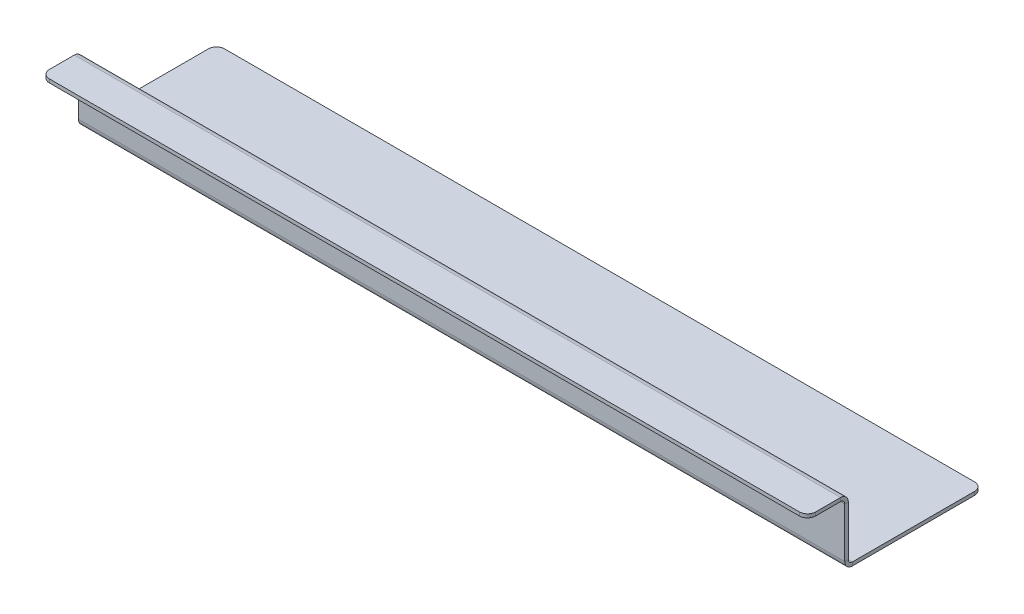
ISO-10303-21;
HEADER;
FILE_DESCRIPTION(('STEP AP214'),'2;1');
FILE_NAME('part.step','',(''),(''),'','','');
FILE_SCHEMA(('AUTOMOTIVE_DESIGN { 1 0 10303 214 1 1 1 1 }'));
ENDSEC;
DATA;
#1=APPLICATION_CONTEXT('core data for automotive mechanical design processes');
#2=APPLICATION_PROTOCOL_DEFINITION('international standard','automotive_design',2000,#1);
#3=PRODUCT_CONTEXT('',#1,'mechanical');
#4=PRODUCT('Part','Part','',(#3));
#5=PRODUCT_RELATED_PRODUCT_CATEGORY('part','',(#4));
#6=PRODUCT_DEFINITION_FORMATION('','',#4);
#7=PRODUCT_DEFINITION_CONTEXT('part definition',#1,'design');
#8=PRODUCT_DEFINITION('design','',#6,#7);
#9=PRODUCT_DEFINITION_SHAPE('','',#8);
#10=(LENGTH_UNIT() NAMED_UNIT(*) SI_UNIT(.MILLI.,.METRE.));
#11=(NAMED_UNIT(*) PLANE_ANGLE_UNIT() SI_UNIT($,.RADIAN.));
#12=(NAMED_UNIT(*) SI_UNIT($,.STERADIAN.) SOLID_ANGLE_UNIT());
#13=UNCERTAINTY_MEASURE_WITH_UNIT(LENGTH_MEASURE(1.E-05),#10,'distance_accuracy_value','');
#14=(GEOMETRIC_REPRESENTATION_CONTEXT(3) GLOBAL_UNCERTAINTY_ASSIGNED_CONTEXT((#13)) GLOBAL_UNIT_ASSIGNED_CONTEXT((#10,
#11,#12)) REPRESENTATION_CONTEXT('',''));
#15=CARTESIAN_POINT('',(0.,0.,0.));
#16=DIRECTION('',(0.,0.,1.));
#17=DIRECTION('',(1.,0.,0.));
#18=AXIS2_PLACEMENT_3D('',#15,#16,#17);
#19=CARTESIAN_POINT('',(596.9,-50.8,-31.7500000000002));
#20=DIRECTION('',(-1.,0.,0.));
#21=DIRECTION('',(0.,0.,1.));
#22=AXIS2_PLACEMENT_3D('',#19,#20,#21);
#23=PLANE('',#22);
#24=DIRECTION('',(0.,0.,1.));
#25=VECTOR('',#24,1.);
#26=CARTESIAN_POINT('',(596.9,-44.87164,-31.7500000000001));
#27=LINE('',#26,#25);
#28=CARTESIAN_POINT('',(596.9,-44.87164,-31.7500000000001));
#29=VERTEX_POINT('',#28);
#30=CARTESIAN_POINT('',(596.9,-44.87164,-28.9966400000001));
#31=VERTEX_POINT('',#30);
#32=EDGE_CURVE('E250',#29,#31,#27,.T.);
#33=ORIENTED_EDGE('',*,*,#32,.F.);
#34=DIRECTION('',(0.,-1.,0.));
#35=VECTOR('',#34,1.);
#36=CARTESIAN_POINT('',(596.9,1.19661315799875E-13,-31.75));
#37=LINE('',#36,#35);
#38=CARTESIAN_POINT('',(596.9,-5.92835999999999,-31.75));
#39=VERTEX_POINT('',#38);
#40=EDGE_CURVE('E258',#39,#29,#37,.T.);
#41=ORIENTED_EDGE('',*,*,#40,.F.);
#42=DIRECTION('',(0.,0.,1.));
#43=VECTOR('',#42,1.);
#44=CARTESIAN_POINT('',(596.9,-5.92836000000001,-28.99664));
#45=LINE('',#44,#43);
#46=CARTESIAN_POINT('',(596.9,-5.92836000000005,-28.99664));
#47=VERTEX_POINT('',#46);
#48=EDGE_CURVE('E269',#47,#39,#45,.F.);
#49=ORIENTED_EDGE('',*,*,#48,.F.);
#50=DIRECTION('',(0.,1.,0.));
#51=VECTOR('',#50,1.);
#52=CARTESIAN_POINT('',(596.9,-50.8,-28.9966400000002));
#53=LINE('',#52,#51);
#54=EDGE_CURVE('E263',#47,#31,#53,.F.);
#55=ORIENTED_EDGE('',*,*,#54,.T.);
#56=EDGE_LOOP('',(#33,#41,#49,#55));
#57=FACE_BOUND('',#56,.T.);
#58=ADVANCED_FACE('F81',(#57),#23,.F.);
#59=CARTESIAN_POINT('',(0.,-2.75335999999999,-31.75));
#60=DIRECTION('',(1.,0.,0.));
#61=DIRECTION('',(0.,0.,-1.));
#62=AXIS2_PLACEMENT_3D('',#59,#60,#61);
#63=PLANE('',#62);
#64=DIRECTION('',(0.,0.,1.));
#65=VECTOR('',#64,1.);
#66=CARTESIAN_POINT('',(0.,-44.87164,-31.7500000000001));
#67=LINE('',#66,#65);
#68=CARTESIAN_POINT('',(0.,-44.87164,-31.7500000000001));
#69=VERTEX_POINT('',#68);
#70=CARTESIAN_POINT('',(0.,-44.87164,-28.9966400000001));
#71=VERTEX_POINT('',#70);
#72=EDGE_CURVE('E243',#69,#71,#67,.T.);
#73=ORIENTED_EDGE('',*,*,#72,.T.);
#74=DIRECTION('',(0.,-1.,0.));
#75=VECTOR('',#74,1.);
#76=CARTESIAN_POINT('',(0.,-2.75336,-28.99664));
#77=LINE('',#76,#75);
#78=CARTESIAN_POINT('',(0.,-5.92835999999997,-28.99664));
#79=VERTEX_POINT('',#78);
#80=EDGE_CURVE('E261',#71,#79,#77,.F.);
#81=ORIENTED_EDGE('',*,*,#80,.T.);
#82=DIRECTION('',(0.,0.,1.));
#83=VECTOR('',#82,1.);
#84=CARTESIAN_POINT('',(0.,-5.92835999999997,-31.75));
#85=LINE('',#84,#83);
#86=CARTESIAN_POINT('',(0.,-5.92835999999996,-31.75));
#87=VERTEX_POINT('',#86);
#88=EDGE_CURVE('E253',#79,#87,#85,.F.);
#89=ORIENTED_EDGE('',*,*,#88,.T.);
#90=DIRECTION('',(0.,1.,0.));
#91=VECTOR('',#90,1.);
#92=CARTESIAN_POINT('',(0.,1.19661315799875E-13,-31.75));
#93=LINE('',#92,#91);
#94=EDGE_CURVE('E255',#69,#87,#93,.T.);
#95=ORIENTED_EDGE('',*,*,#94,.F.);
#96=EDGE_LOOP('',(#73,#81,#89,#95));
#97=FACE_BOUND('',#96,.T.);
#98=ADVANCED_FACE('F383',(#97),#63,.F.);
#99=CARTESIAN_POINT('',(0.,1.19661315799875E-13,-31.75));
#100=DIRECTION('',(0.,0.,1.));
#101=DIRECTION('',(0.,-1.,0.));
#102=AXIS2_PLACEMENT_3D('',#99,#100,#101);
#103=PLANE('',#102);
#104=DIRECTION('',(-1.,0.,0.));
#105=VECTOR('',#104,1.);
#106=CARTESIAN_POINT('',(0.,-44.87164,-31.7500000000001));
#107=LINE('',#106,#105);
#108=EDGE_CURVE('E247',#69,#29,#107,.F.);
#109=ORIENTED_EDGE('',*,*,#108,.F.);
#110=ORIENTED_EDGE('',*,*,#94,.T.);
#111=DIRECTION('',(1.,0.,0.));
#112=VECTOR('',#111,1.);
#113=CARTESIAN_POINT('',(0.,-5.92835999999997,-31.75));
#114=LINE('',#113,#112);
#115=EDGE_CURVE('E266',#39,#87,#114,.F.);
#116=ORIENTED_EDGE('',*,*,#115,.F.);
#117=ORIENTED_EDGE('',*,*,#40,.T.);
#118=EDGE_LOOP('',(#109,#110,#116,#117));
#119=FACE_BOUND('',#118,.T.);
#120=ADVANCED_FACE('F372',(#119),#103,.F.);
#121=CARTESIAN_POINT('',(0.,1.10048010740757E-13,-28.99664));
#122=DIRECTION('',(0.,0.,1.));
#123=DIRECTION('',(0.,-1.,0.));
#124=AXIS2_PLACEMENT_3D('',#121,#122,#123);
#125=PLANE('',#124);
#126=ORIENTED_EDGE('',*,*,#80,.F.);
#127=DIRECTION('',(-1.,0.,0.));
#128=VECTOR('',#127,1.);
#129=CARTESIAN_POINT('',(0.,-44.87164,-28.9966400000001));
#130=LINE('',#129,#128);
#131=EDGE_CURVE('E204',#71,#31,#130,.F.);
#132=ORIENTED_EDGE('',*,*,#131,.T.);
#133=ORIENTED_EDGE('',*,*,#54,.F.);
#134=DIRECTION('',(1.,0.,0.));
#135=VECTOR('',#134,1.);
#136=CARTESIAN_POINT('',(0.,-5.92835999999999,-28.99664));
#137=LINE('',#136,#135);
#138=EDGE_CURVE('E272',#79,#47,#137,.T.);
#139=ORIENTED_EDGE('',*,*,#138,.F.);
#140=EDGE_LOOP('',(#126,#132,#133,#139));
#141=FACE_BOUND('',#140,.T.);
#142=ADVANCED_FACE('F387',(#141),#125,.T.);
#143=CARTESIAN_POINT('',(596.9,-2.75336,0.));
#144=DIRECTION('',(1.,0.,0.));
#145=DIRECTION('',(0.,0.,-1.));
#146=AXIS2_PLACEMENT_3D('',#143,#144,#145);
#147=PLANE('',#146);
#148=DIRECTION('',(0.,0.,-1.));
#149=VECTOR('',#148,1.);
#150=CARTESIAN_POINT('',(596.9,0.,0.));
#151=LINE('',#150,#149);
#152=CARTESIAN_POINT('',(596.9,0.,-6.35));
#153=VERTEX_POINT('',#152);
#154=CARTESIAN_POINT('',(596.9,0.,-25.82164));
#155=VERTEX_POINT('',#154);
#156=EDGE_CURVE('E303',#153,#155,#151,.T.);
#157=ORIENTED_EDGE('',*,*,#156,.F.);
#158=DIRECTION('',(0.,1.,0.));
#159=VECTOR('',#158,1.);
#160=CARTESIAN_POINT('',(596.9,-2.75336,-6.35));
#161=LINE('',#160,#159);
#162=CARTESIAN_POINT('',(596.9,-2.75336,-6.35));
#163=VERTEX_POINT('',#162);
#164=EDGE_CURVE('E323',#153,#163,#161,.F.);
#165=ORIENTED_EDGE('',*,*,#164,.T.);
#166=DIRECTION('',(0.,0.,-1.));
#167=VECTOR('',#166,1.);
#168=CARTESIAN_POINT('',(596.9,-2.75336,0.));
#169=LINE('',#168,#167);
#170=CARTESIAN_POINT('',(596.9,-2.75336,-25.82164));
#171=VERTEX_POINT('',#170);
#172=EDGE_CURVE('E306',#163,#171,#169,.T.);
#173=ORIENTED_EDGE('',*,*,#172,.T.);
#174=DIRECTION('',(0.,1.,0.));
#175=VECTOR('',#174,1.);
#176=CARTESIAN_POINT('',(596.9,-2.75336000000006,-25.82164));
#177=LINE('',#176,#175);
#178=EDGE_CURVE('E282',#171,#155,#177,.T.);
#179=ORIENTED_EDGE('',*,*,#178,.T.);
#180=EDGE_LOOP('',(#157,#165,#173,#179));
#181=FACE_BOUND('',#180,.T.);
#182=ADVANCED_FACE('F396',(#181),#147,.T.);
#183=CARTESIAN_POINT('',(0.,-2.75336,0.));
#184=DIRECTION('',(0.,-1.,0.));
#185=DIRECTION('',(0.,0.,-1.));
#186=AXIS2_PLACEMENT_3D('',#183,#184,#185);
#187=PLANE('',#186);
#188=ORIENTED_EDGE('',*,*,#172,.F.);
#189=CARTESIAN_POINT('',(590.55,-2.75336,-6.35));
#190=DIRECTION('',(0.,-1.,0.));
#191=DIRECTION('',(0.,0.,-1.));
#192=AXIS2_PLACEMENT_3D('',#189,#190,#191);
#193=CIRCLE('',#192,6.35);
#194=CARTESIAN_POINT('',(590.55,-2.75336,0.));
#195=VERTEX_POINT('',#194);
#196=EDGE_CURVE('E327',#163,#195,#193,.T.);
#197=ORIENTED_EDGE('',*,*,#196,.T.);
#198=DIRECTION('',(1.,0.,0.));
#199=VECTOR('',#198,1.);
#200=CARTESIAN_POINT('',(0.,-2.75336,0.));
#201=LINE('',#200,#199);
#202=CARTESIAN_POINT('',(6.35,-2.75336,0.));
#203=VERTEX_POINT('',#202);
#204=EDGE_CURVE('E302',#203,#195,#201,.T.);
#205=ORIENTED_EDGE('',*,*,#204,.F.);
#206=CARTESIAN_POINT('',(6.35,-2.75336,-6.35));
#207=DIRECTION('',(0.,-1.,0.));
#208=DIRECTION('',(0.,0.,-1.));
#209=AXIS2_PLACEMENT_3D('',#206,#207,#208);
#210=CIRCLE('',#209,6.35);
#211=CARTESIAN_POINT('',(0.,-2.75336,-6.35));
#212=VERTEX_POINT('',#211);
#213=EDGE_CURVE('E325',#203,#212,#210,.T.);
#214=ORIENTED_EDGE('',*,*,#213,.T.);
#215=DIRECTION('',(0.,0.,1.));
#216=VECTOR('',#215,1.);
#217=CARTESIAN_POINT('',(0.,-2.75336,0.));
#218=LINE('',#217,#216);
#219=CARTESIAN_POINT('',(0.,-2.75336,-25.82164));
#220=VERTEX_POINT('',#219);
#221=EDGE_CURVE('E299',#220,#212,#218,.T.);
#222=ORIENTED_EDGE('',*,*,#221,.F.);
#223=DIRECTION('',(1.,0.,0.));
#224=VECTOR('',#223,1.);
#225=CARTESIAN_POINT('',(596.9,-2.75336000000006,-25.82164));
#226=LINE('',#225,#224);
#227=EDGE_CURVE('E288',#171,#220,#226,.F.);
#228=ORIENTED_EDGE('',*,*,#227,.F.);
#229=EDGE_LOOP('',(#188,#197,#205,#214,#222,#228));
#230=FACE_BOUND('',#229,.T.);
#231=ADVANCED_FACE('F419',(#230),#187,.T.);
#232=CARTESIAN_POINT('',(0.,0.,0.));
#233=DIRECTION('',(0.,-1.,0.));
#234=DIRECTION('',(0.,0.,-1.));
#235=AXIS2_PLACEMENT_3D('',#232,#233,#234);
#236=PLANE('',#235);
#237=DIRECTION('',(1.,0.,0.));
#238=VECTOR('',#237,1.);
#239=CARTESIAN_POINT('',(0.,0.,0.));
#240=LINE('',#239,#238);
#241=CARTESIAN_POINT('',(6.35,0.,0.));
#242=VERTEX_POINT('',#241);
#243=CARTESIAN_POINT('',(590.55,0.,0.));
#244=VERTEX_POINT('',#243);
#245=EDGE_CURVE('E311',#242,#244,#240,.T.);
#246=ORIENTED_EDGE('',*,*,#245,.T.);
#247=CARTESIAN_POINT('',(590.55,0.,-6.35));
#248=DIRECTION('',(0.,-1.,0.));
#249=DIRECTION('',(0.,0.,-1.));
#250=AXIS2_PLACEMENT_3D('',#247,#248,#249);
#251=CIRCLE('',#250,6.35);
#252=EDGE_CURVE('E321',#244,#153,#251,.F.);
#253=ORIENTED_EDGE('',*,*,#252,.T.);
#254=ORIENTED_EDGE('',*,*,#156,.T.);
#255=DIRECTION('',(1.,0.,0.));
#256=VECTOR('',#255,1.);
#257=CARTESIAN_POINT('',(596.9,0.,-25.82164));
#258=LINE('',#257,#256);
#259=CARTESIAN_POINT('',(0.,0.,-25.82164));
#260=VERTEX_POINT('',#259);
#261=EDGE_CURVE('E276',#155,#260,#258,.F.);
#262=ORIENTED_EDGE('',*,*,#261,.T.);
#263=DIRECTION('',(0.,0.,1.));
#264=VECTOR('',#263,1.);
#265=CARTESIAN_POINT('',(0.,0.,0.));
#266=LINE('',#265,#264);
#267=CARTESIAN_POINT('',(0.,0.,-6.35));
#268=VERTEX_POINT('',#267);
#269=EDGE_CURVE('E296',#260,#268,#266,.T.);
#270=ORIENTED_EDGE('',*,*,#269,.T.);
#271=CARTESIAN_POINT('',(6.35,0.,-6.35));
#272=DIRECTION('',(0.,-1.,0.));
#273=DIRECTION('',(0.,0.,-1.));
#274=AXIS2_PLACEMENT_3D('',#271,#272,#273);
#275=CIRCLE('',#274,6.35);
#276=EDGE_CURVE('E319',#268,#242,#275,.F.);
#277=ORIENTED_EDGE('',*,*,#276,.T.);
#278=EDGE_LOOP('',(#246,#253,#254,#262,#270,#277));
#279=FACE_BOUND('',#278,.T.);
#280=ADVANCED_FACE('F402',(#279),#236,.F.);
#281=CARTESIAN_POINT('',(0.,-2.75336,0.));
#282=DIRECTION('',(-1.,0.,0.));
#283=DIRECTION('',(0.,0.,1.));
#284=AXIS2_PLACEMENT_3D('',#281,#282,#283);
#285=PLANE('',#284);
#286=ORIENTED_EDGE('',*,*,#221,.T.);
#287=DIRECTION('',(0.,1.,0.));
#288=VECTOR('',#287,1.);
#289=CARTESIAN_POINT('',(0.,-2.75336,-6.35));
#290=LINE('',#289,#288);
#291=EDGE_CURVE('E13',#212,#268,#290,.T.);
#292=ORIENTED_EDGE('',*,*,#291,.T.);
#293=ORIENTED_EDGE('',*,*,#269,.F.);
#294=DIRECTION('',(0.,1.,0.));
#295=VECTOR('',#294,1.);
#296=CARTESIAN_POINT('',(0.,-2.75335999999998,-25.82164));
#297=LINE('',#296,#295);
#298=EDGE_CURVE('E293',#220,#260,#297,.T.);
#299=ORIENTED_EDGE('',*,*,#298,.F.);
#300=EDGE_LOOP('',(#286,#292,#293,#299));
#301=FACE_BOUND('',#300,.T.);
#302=ADVANCED_FACE('F404',(#301),#285,.T.);
#303=CARTESIAN_POINT('',(0.,-2.75336,0.));
#304=DIRECTION('',(0.,0.,1.));
#305=DIRECTION('',(1.,0.,0.));
#306=AXIS2_PLACEMENT_3D('',#303,#304,#305);
#307=PLANE('',#306);
#308=ORIENTED_EDGE('',*,*,#204,.T.);
#309=DIRECTION('',(0.,1.,0.));
#310=VECTOR('',#309,1.);
#311=CARTESIAN_POINT('',(590.55,-2.75336,0.));
#312=LINE('',#311,#310);
#313=EDGE_CURVE('E316',#195,#244,#312,.T.);
#314=ORIENTED_EDGE('',*,*,#313,.T.);
#315=ORIENTED_EDGE('',*,*,#245,.F.);
#316=DIRECTION('',(0.,1.,0.));
#317=VECTOR('',#316,1.);
#318=CARTESIAN_POINT('',(6.35,-2.75336,0.));
#319=LINE('',#318,#317);
#320=EDGE_CURVE('E308',#242,#203,#319,.F.);
#321=ORIENTED_EDGE('',*,*,#320,.T.);
#322=EDGE_LOOP('',(#308,#314,#315,#321));
#323=FACE_BOUND('',#322,.T.);
#324=ADVANCED_FACE('F412',(#323),#307,.T.);
#325=CARTESIAN_POINT('',(0.,-5.92835999999998,-25.82164));
#326=DIRECTION('',(-1.,0.,0.));
#327=DIRECTION('',(0.,-1.,0.));
#328=AXIS2_PLACEMENT_3D('',#325,#326,#327);
#329=PLANE('',#328);
#330=ORIENTED_EDGE('',*,*,#88,.F.);
#331=CARTESIAN_POINT('',(0.,-5.92835999999998,-25.82164));
#332=DIRECTION('',(1.,0.,0.));
#333=DIRECTION('',(0.,1.,0.));
#334=AXIS2_PLACEMENT_3D('',#331,#332,#333);
#335=CIRCLE('',#334,3.175);
#336=EDGE_CURVE('E285',#220,#79,#335,.F.);
#337=ORIENTED_EDGE('',*,*,#336,.F.);
#338=ORIENTED_EDGE('',*,*,#298,.T.);
#339=CARTESIAN_POINT('',(0.,-5.92835999999998,-25.82164));
#340=DIRECTION('',(1.,0.,0.));
#341=DIRECTION('',(0.,1.,0.));
#342=AXIS2_PLACEMENT_3D('',#339,#340,#341);
#343=CIRCLE('',#342,5.92836);
#344=EDGE_CURVE('E278',#260,#87,#343,.F.);
#345=ORIENTED_EDGE('',*,*,#344,.T.);
#346=EDGE_LOOP('',(#330,#337,#338,#345));
#347=FACE_BOUND('',#346,.T.);
#348=ADVANCED_FACE('F380',(#347),#329,.T.);
#349=CARTESIAN_POINT('',(596.9,-5.92836000000006,-25.82164));
#350=DIRECTION('',(-1.,0.,0.));
#351=DIRECTION('',(0.,-1.,0.));
#352=AXIS2_PLACEMENT_3D('',#349,#350,#351);
#353=PLANE('',#352);
#354=CARTESIAN_POINT('',(596.9,-5.92836000000006,-25.82164));
#355=DIRECTION('',(1.,0.,0.));
#356=DIRECTION('',(0.,1.,0.));
#357=AXIS2_PLACEMENT_3D('',#354,#355,#356);
#358=CIRCLE('',#357,3.175);
#359=EDGE_CURVE('E257',#47,#171,#358,.T.);
#360=ORIENTED_EDGE('',*,*,#359,.F.);
#361=ORIENTED_EDGE('',*,*,#48,.T.);
#362=CARTESIAN_POINT('',(596.9,-5.92836000000006,-25.82164));
#363=DIRECTION('',(1.,0.,0.));
#364=DIRECTION('',(0.,1.,0.));
#365=AXIS2_PLACEMENT_3D('',#362,#363,#364);
#366=CIRCLE('',#365,5.92836);
#367=EDGE_CURVE('E279',#39,#155,#366,.T.);
#368=ORIENTED_EDGE('',*,*,#367,.T.);
#369=ORIENTED_EDGE('',*,*,#178,.F.);
#370=EDGE_LOOP('',(#360,#361,#368,#369));
#371=FACE_BOUND('',#370,.T.);
#372=ADVANCED_FACE('F393',(#371),#353,.F.);
#373=CARTESIAN_POINT('',(596.9,-5.92836000000006,-25.82164));
#374=DIRECTION('',(1.,0.,0.));
#375=DIRECTION('',(0.,0.,-1.));
#376=AXIS2_PLACEMENT_3D('',#373,#374,#375);
#377=CYLINDRICAL_SURFACE('',#376,5.92836);
#378=ORIENTED_EDGE('',*,*,#261,.F.);
#379=ORIENTED_EDGE('',*,*,#367,.F.);
#380=ORIENTED_EDGE('',*,*,#115,.T.);
#381=ORIENTED_EDGE('',*,*,#344,.F.);
#382=EDGE_LOOP('',(#378,#379,#380,#381));
#383=FACE_BOUND('',#382,.T.);
#384=ADVANCED_FACE('F377',(#383),#377,.T.);
#385=CARTESIAN_POINT('',(596.9,-5.92836000000006,-25.82164));
#386=DIRECTION('',(1.,0.,0.));
#387=DIRECTION('',(0.,0.,-1.));
#388=AXIS2_PLACEMENT_3D('',#385,#386,#387);
#389=CYLINDRICAL_SURFACE('',#388,3.175);
#390=ORIENTED_EDGE('',*,*,#227,.T.);
#391=ORIENTED_EDGE('',*,*,#336,.T.);
#392=ORIENTED_EDGE('',*,*,#138,.T.);
#393=ORIENTED_EDGE('',*,*,#359,.T.);
#394=EDGE_LOOP('',(#390,#391,#392,#393));
#395=FACE_BOUND('',#394,.T.);
#396=ADVANCED_FACE('F390',(#395),#389,.F.);
#397=CARTESIAN_POINT('',(596.9,-44.87164,-34.9250000000002));
#398=DIRECTION('',(1.,0.,0.));
#399=DIRECTION('',(0.,0.,-1.));
#400=AXIS2_PLACEMENT_3D('',#397,#398,#399);
#401=PLANE('',#400);
#402=DIRECTION('',(0.,1.,0.));
#403=VECTOR('',#402,1.);
#404=CARTESIAN_POINT('',(596.9,-50.8,-34.9250000000002));
#405=LINE('',#404,#403);
#406=CARTESIAN_POINT('',(596.9,-48.04664,-34.9250000000002));
#407=VERTEX_POINT('',#406);
#408=CARTESIAN_POINT('',(596.9,-50.8,-34.9250000000002));
#409=VERTEX_POINT('',#408);
#410=EDGE_CURVE('E238',#407,#409,#405,.F.);
#411=ORIENTED_EDGE('',*,*,#410,.F.);
#412=CARTESIAN_POINT('',(596.9,-44.87164,-34.9250000000002));
#413=DIRECTION('',(-1.,0.,0.));
#414=DIRECTION('',(0.,0.,1.));
#415=AXIS2_PLACEMENT_3D('',#412,#413,#414);
#416=CIRCLE('',#415,3.175);
#417=EDGE_CURVE('E207',#29,#407,#416,.F.);
#418=ORIENTED_EDGE('',*,*,#417,.F.);
#419=ORIENTED_EDGE('',*,*,#32,.T.);
#420=CARTESIAN_POINT('',(596.9,-44.87164,-34.9250000000002));
#421=DIRECTION('',(-1.,0.,0.));
#422=DIRECTION('',(0.,0.,1.));
#423=AXIS2_PLACEMENT_3D('',#420,#421,#422);
#424=CIRCLE('',#423,5.92836);
#425=EDGE_CURVE('E242',#31,#409,#424,.F.);
#426=ORIENTED_EDGE('',*,*,#425,.T.);
#427=EDGE_LOOP('',(#411,#418,#419,#426));
#428=FACE_BOUND('',#427,.T.);
#429=ADVANCED_FACE('F365',(#428),#401,.T.);
#430=CARTESIAN_POINT('',(0.,-44.87164,-34.9250000000002));
#431=DIRECTION('',(1.,0.,0.));
#432=DIRECTION('',(0.,0.,-1.));
#433=AXIS2_PLACEMENT_3D('',#430,#431,#432);
#434=PLANE('',#433);
#435=CARTESIAN_POINT('',(0.,-44.87164,-34.9250000000002));
#436=DIRECTION('',(-1.,0.,0.));
#437=DIRECTION('',(0.,0.,1.));
#438=AXIS2_PLACEMENT_3D('',#435,#436,#437);
#439=CIRCLE('',#438,3.175);
#440=CARTESIAN_POINT('',(0.,-48.04664,-34.9250000000002));
#441=VERTEX_POINT('',#440);
#442=EDGE_CURVE('E214',#441,#69,#439,.T.);
#443=ORIENTED_EDGE('',*,*,#442,.F.);
#444=DIRECTION('',(0.,1.,0.));
#445=VECTOR('',#444,1.);
#446=CARTESIAN_POINT('',(0.,-48.04664,-34.9250000000001));
#447=LINE('',#446,#445);
#448=CARTESIAN_POINT('',(0.,-50.8,-34.9250000000001));
#449=VERTEX_POINT('',#448);
#450=EDGE_CURVE('E211',#441,#449,#447,.F.);
#451=ORIENTED_EDGE('',*,*,#450,.T.);
#452=CARTESIAN_POINT('',(0.,-44.87164,-34.9250000000002));
#453=DIRECTION('',(-1.,0.,0.));
#454=DIRECTION('',(0.,0.,1.));
#455=AXIS2_PLACEMENT_3D('',#452,#453,#454);
#456=CIRCLE('',#455,5.92836);
#457=EDGE_CURVE('E197',#449,#71,#456,.T.);
#458=ORIENTED_EDGE('',*,*,#457,.T.);
#459=ORIENTED_EDGE('',*,*,#72,.F.);
#460=EDGE_LOOP('',(#443,#451,#458,#459));
#461=FACE_BOUND('',#460,.T.);
#462=ADVANCED_FACE('F212',(#461),#434,.F.);
#463=CARTESIAN_POINT('',(0.,-44.87164,-34.9250000000002));
#464=DIRECTION('',(-1.,0.,0.));
#465=DIRECTION('',(0.,-1.,0.));
#466=AXIS2_PLACEMENT_3D('',#463,#464,#465);
#467=CYLINDRICAL_SURFACE('',#466,5.92836);
#468=ORIENTED_EDGE('',*,*,#131,.F.);
#469=ORIENTED_EDGE('',*,*,#457,.F.);
#470=DIRECTION('',(-1.,0.,0.));
#471=VECTOR('',#470,1.);
#472=CARTESIAN_POINT('',(596.9,-50.8,-34.9250000000002));
#473=LINE('',#472,#471);
#474=EDGE_CURVE('E201',#449,#409,#473,.F.);
#475=ORIENTED_EDGE('',*,*,#474,.T.);
#476=ORIENTED_EDGE('',*,*,#425,.F.);
#477=EDGE_LOOP('',(#468,#469,#475,#476));
#478=FACE_BOUND('',#477,.T.);
#479=ADVANCED_FACE('F199',(#478),#467,.T.);
#480=CARTESIAN_POINT('',(0.,-44.87164,-34.9250000000002));
#481=DIRECTION('',(-1.,0.,0.));
#482=DIRECTION('',(0.,-1.,0.));
#483=AXIS2_PLACEMENT_3D('',#480,#481,#482);
#484=CYLINDRICAL_SURFACE('',#483,3.175);
#485=ORIENTED_EDGE('',*,*,#108,.T.);
#486=ORIENTED_EDGE('',*,*,#417,.T.);
#487=DIRECTION('',(-1.,0.,0.));
#488=VECTOR('',#487,1.);
#489=CARTESIAN_POINT('',(596.9,-48.04664,-34.9250000000002));
#490=LINE('',#489,#488);
#491=EDGE_CURVE('E216',#407,#441,#490,.T.);
#492=ORIENTED_EDGE('',*,*,#491,.T.);
#493=ORIENTED_EDGE('',*,*,#442,.T.);
#494=EDGE_LOOP('',(#485,#486,#492,#493));
#495=FACE_BOUND('',#494,.T.);
#496=ADVANCED_FACE('F360',(#495),#484,.F.);
#497=CARTESIAN_POINT('',(596.9,-50.8,-31.7500000000002));
#498=DIRECTION('',(-1.,0.,0.));
#499=DIRECTION('',(0.,0.,1.));
#500=AXIS2_PLACEMENT_3D('',#497,#498,#499);
#501=PLANE('',#500);
#502=DIRECTION('',(0.,0.,1.));
#503=VECTOR('',#502,1.);
#504=CARTESIAN_POINT('',(596.9,-50.8,0.));
#505=LINE('',#504,#503);
#506=CARTESIAN_POINT('',(596.9,-50.8,-130.175));
#507=VERTEX_POINT('',#506);
#508=EDGE_CURVE('E223',#507,#409,#505,.T.);
#509=ORIENTED_EDGE('',*,*,#508,.F.);
#510=DIRECTION('',(0.,1.,0.));
#511=VECTOR('',#510,1.);
#512=CARTESIAN_POINT('',(596.9,-50.8,-130.175));
#513=LINE('',#512,#511);
#514=CARTESIAN_POINT('',(596.9,-48.04664,-130.175));
#515=VERTEX_POINT('',#514);
#516=EDGE_CURVE('E329',#507,#515,#513,.T.);
#517=ORIENTED_EDGE('',*,*,#516,.T.);
#518=DIRECTION('',(0.,0.,-1.));
#519=VECTOR('',#518,1.);
#520=CARTESIAN_POINT('',(596.9,-48.04664,-31.7500000000002));
#521=LINE('',#520,#519);
#522=EDGE_CURVE('E224',#515,#407,#521,.F.);
#523=ORIENTED_EDGE('',*,*,#522,.T.);
#524=ORIENTED_EDGE('',*,*,#410,.T.);
#525=EDGE_LOOP('',(#509,#517,#523,#524));
#526=FACE_BOUND('',#525,.T.);
#527=ADVANCED_FACE('F347',(#526),#501,.F.);
#528=CARTESIAN_POINT('',(0.,-50.8,-136.525));
#529=DIRECTION('',(1.,0.,0.));
#530=DIRECTION('',(0.,0.,-1.));
#531=AXIS2_PLACEMENT_3D('',#528,#529,#530);
#532=PLANE('',#531);
#533=DIRECTION('',(0.,0.,1.));
#534=VECTOR('',#533,1.);
#535=CARTESIAN_POINT('',(0.,-48.04664,-136.525));
#536=LINE('',#535,#534);
#537=CARTESIAN_POINT('',(0.,-48.04664,-130.175));
#538=VERTEX_POINT('',#537);
#539=EDGE_CURVE('E234',#441,#538,#536,.F.);
#540=ORIENTED_EDGE('',*,*,#539,.T.);
#541=DIRECTION('',(0.,1.,0.));
#542=VECTOR('',#541,1.);
#543=CARTESIAN_POINT('',(0.,-50.8,-130.175));
#544=LINE('',#543,#542);
#545=CARTESIAN_POINT('',(0.,-50.8,-130.175));
#546=VERTEX_POINT('',#545);
#547=EDGE_CURVE('E89',#538,#546,#544,.F.);
#548=ORIENTED_EDGE('',*,*,#547,.T.);
#549=DIRECTION('',(0.,0.,-1.));
#550=VECTOR('',#549,1.);
#551=CARTESIAN_POINT('',(0.,-50.8,0.));
#552=LINE('',#551,#550);
#553=EDGE_CURVE('E220',#449,#546,#552,.T.);
#554=ORIENTED_EDGE('',*,*,#553,.F.);
#555=ORIENTED_EDGE('',*,*,#450,.F.);
#556=EDGE_LOOP('',(#540,#548,#554,#555));
#557=FACE_BOUND('',#556,.T.);
#558=ADVANCED_FACE('F226',(#557),#532,.F.);
#559=CARTESIAN_POINT('',(0.,-50.8,0.));
#560=DIRECTION('',(0.,1.,0.));
#561=DIRECTION('',(0.,0.,1.));
#562=AXIS2_PLACEMENT_3D('',#559,#560,#561);
#563=PLANE('',#562);
#564=DIRECTION('',(1.,0.,0.));
#565=VECTOR('',#564,1.);
#566=CARTESIAN_POINT('',(0.,-50.8,-136.525));
#567=LINE('',#566,#565);
#568=CARTESIAN_POINT('',(6.34999999999997,-50.8,-136.525));
#569=VERTEX_POINT('',#568);
#570=CARTESIAN_POINT('',(590.55,-50.8,-136.525));
#571=VERTEX_POINT('',#570);
#572=EDGE_CURVE('E227',#569,#571,#567,.T.);
#573=ORIENTED_EDGE('',*,*,#572,.T.);
#574=CARTESIAN_POINT('',(590.55,-50.8,-130.175));
#575=DIRECTION('',(0.,1.,0.));
#576=DIRECTION('',(0.,0.,1.));
#577=AXIS2_PLACEMENT_3D('',#574,#575,#576);
#578=CIRCLE('',#577,6.35);
#579=EDGE_CURVE('E342',#571,#507,#578,.F.);
#580=ORIENTED_EDGE('',*,*,#579,.T.);
#581=ORIENTED_EDGE('',*,*,#508,.T.);
#582=ORIENTED_EDGE('',*,*,#474,.F.);
#583=ORIENTED_EDGE('',*,*,#553,.T.);
#584=CARTESIAN_POINT('',(6.34999999999997,-50.8,-130.175));
#585=DIRECTION('',(0.,1.,0.));
#586=DIRECTION('',(0.,0.,1.));
#587=AXIS2_PLACEMENT_3D('',#584,#585,#586);
#588=CIRCLE('',#587,6.35);
#589=EDGE_CURVE('E340',#546,#569,#588,.F.);
#590=ORIENTED_EDGE('',*,*,#589,.T.);
#591=EDGE_LOOP('',(#573,#580,#581,#582,#583,#590));
#592=FACE_BOUND('',#591,.T.);
#593=ADVANCED_FACE('F219',(#592),#563,.F.);
#594=CARTESIAN_POINT('',(0.,-48.04664,0.));
#595=DIRECTION('',(0.,1.,0.));
#596=DIRECTION('',(0.,0.,1.));
#597=AXIS2_PLACEMENT_3D('',#594,#595,#596);
#598=PLANE('',#597);
#599=ORIENTED_EDGE('',*,*,#522,.F.);
#600=CARTESIAN_POINT('',(590.55,-48.04664,-130.175));
#601=DIRECTION('',(0.,1.,0.));
#602=DIRECTION('',(0.,0.,1.));
#603=AXIS2_PLACEMENT_3D('',#600,#601,#602);
#604=CIRCLE('',#603,6.35);
#605=CARTESIAN_POINT('',(590.55,-48.04664,-136.525));
#606=VERTEX_POINT('',#605);
#607=EDGE_CURVE('E334',#515,#606,#604,.T.);
#608=ORIENTED_EDGE('',*,*,#607,.T.);
#609=DIRECTION('',(-1.,0.,0.));
#610=VECTOR('',#609,1.);
#611=CARTESIAN_POINT('',(596.9,-48.04664,-136.525));
#612=LINE('',#611,#610);
#613=CARTESIAN_POINT('',(6.34999999999997,-48.04664,-136.525));
#614=VERTEX_POINT('',#613);
#615=EDGE_CURVE('E230',#614,#606,#612,.F.);
#616=ORIENTED_EDGE('',*,*,#615,.F.);
#617=CARTESIAN_POINT('',(6.34999999999997,-48.04664,-130.175));
#618=DIRECTION('',(0.,1.,0.));
#619=DIRECTION('',(0.,0.,1.));
#620=AXIS2_PLACEMENT_3D('',#617,#618,#619);
#621=CIRCLE('',#620,6.35);
#622=EDGE_CURVE('E332',#614,#538,#621,.T.);
#623=ORIENTED_EDGE('',*,*,#622,.T.);
#624=ORIENTED_EDGE('',*,*,#539,.F.);
#625=ORIENTED_EDGE('',*,*,#491,.F.);
#626=EDGE_LOOP('',(#599,#608,#616,#623,#624,#625));
#627=FACE_BOUND('',#626,.T.);
#628=ADVANCED_FACE('F353',(#627),#598,.T.);
#629=CARTESIAN_POINT('',(596.9,-50.8,-136.525));
#630=DIRECTION('',(0.,0.,1.));
#631=DIRECTION('',(0.,-1.,0.));
#632=AXIS2_PLACEMENT_3D('',#629,#630,#631);
#633=PLANE('',#632);
#634=ORIENTED_EDGE('',*,*,#615,.T.);
#635=DIRECTION('',(0.,1.,0.));
#636=VECTOR('',#635,1.);
#637=CARTESIAN_POINT('',(590.55,-50.8,-136.525));
#638=LINE('',#637,#636);
#639=EDGE_CURVE('E103',#606,#571,#638,.F.);
#640=ORIENTED_EDGE('',*,*,#639,.T.);
#641=ORIENTED_EDGE('',*,*,#572,.F.);
#642=DIRECTION('',(0.,1.,0.));
#643=VECTOR('',#642,1.);
#644=CARTESIAN_POINT('',(6.34999999999997,-50.8,-136.525));
#645=LINE('',#644,#643);
#646=EDGE_CURVE('E336',#569,#614,#645,.T.);
#647=ORIENTED_EDGE('',*,*,#646,.T.);
#648=EDGE_LOOP('',(#634,#640,#641,#647));
#649=FACE_BOUND('',#648,.T.);
#650=ADVANCED_FACE('F355',(#649),#633,.F.);
#651=CARTESIAN_POINT('',(590.55,-2.75336,-6.35));
#652=DIRECTION('',(0.,1.,0.));
#653=DIRECTION('',(0.,0.,1.));
#654=AXIS2_PLACEMENT_3D('',#651,#652,#653);
#655=CYLINDRICAL_SURFACE('',#654,6.35);
#656=ORIENTED_EDGE('',*,*,#196,.F.);
#657=ORIENTED_EDGE('',*,*,#164,.F.);
#658=ORIENTED_EDGE('',*,*,#252,.F.);
#659=ORIENTED_EDGE('',*,*,#313,.F.);
#660=EDGE_LOOP('',(#656,#657,#658,#659));
#661=FACE_BOUND('',#660,.T.);
#662=ADVANCED_FACE('F417',(#661),#655,.T.);
#663=CARTESIAN_POINT('',(590.55,-50.8,-130.175));
#664=DIRECTION('',(0.,1.,0.));
#665=DIRECTION('',(0.,0.,1.));
#666=AXIS2_PLACEMENT_3D('',#663,#664,#665);
#667=CYLINDRICAL_SURFACE('',#666,6.35);
#668=ORIENTED_EDGE('',*,*,#579,.F.);
#669=ORIENTED_EDGE('',*,*,#639,.F.);
#670=ORIENTED_EDGE('',*,*,#607,.F.);
#671=ORIENTED_EDGE('',*,*,#516,.F.);
#672=EDGE_LOOP('',(#668,#669,#670,#671));
#673=FACE_BOUND('',#672,.T.);
#674=ADVANCED_FACE('F350',(#673),#667,.T.);
#675=CARTESIAN_POINT('',(6.34999999999997,-50.8,-130.175));
#676=DIRECTION('',(0.,1.,0.));
#677=DIRECTION('',(0.,0.,1.));
#678=AXIS2_PLACEMENT_3D('',#675,#676,#677);
#679=CYLINDRICAL_SURFACE('',#678,6.35);
#680=ORIENTED_EDGE('',*,*,#589,.F.);
#681=ORIENTED_EDGE('',*,*,#547,.F.);
#682=ORIENTED_EDGE('',*,*,#622,.F.);
#683=ORIENTED_EDGE('',*,*,#646,.F.);
#684=EDGE_LOOP('',(#680,#681,#682,#683));
#685=FACE_BOUND('',#684,.T.);
#686=ADVANCED_FACE('F358',(#685),#679,.T.);
#687=CARTESIAN_POINT('',(6.35,-2.75336,-6.35));
#688=DIRECTION('',(0.,1.,0.));
#689=DIRECTION('',(0.,0.,1.));
#690=AXIS2_PLACEMENT_3D('',#687,#688,#689);
#691=CYLINDRICAL_SURFACE('',#690,6.35);
#692=ORIENTED_EDGE('',*,*,#213,.F.);
#693=ORIENTED_EDGE('',*,*,#320,.F.);
#694=ORIENTED_EDGE('',*,*,#276,.F.);
#695=ORIENTED_EDGE('',*,*,#291,.F.);
#696=EDGE_LOOP('',(#692,#693,#694,#695));
#697=FACE_BOUND('',#696,.T.);
#698=ADVANCED_FACE('F83',(#697),#691,.T.);
#699=CLOSED_SHELL('',(#58,#98,#120,#142,#182,#231,#280,#302,#324,#348,#372,#384,#396,#429,#462,
#479,#496,#527,#558,#593,#628,#650,#662,#674,#686,#698));
#700=MANIFOLD_SOLID_BREP('B2',#699);
#701=ADVANCED_BREP_SHAPE_REPRESENTATION('',(#18,#700),#14);
#702=SHAPE_DEFINITION_REPRESENTATION(#9,#701);
ENDSEC;
END-ISO-10303-21;
